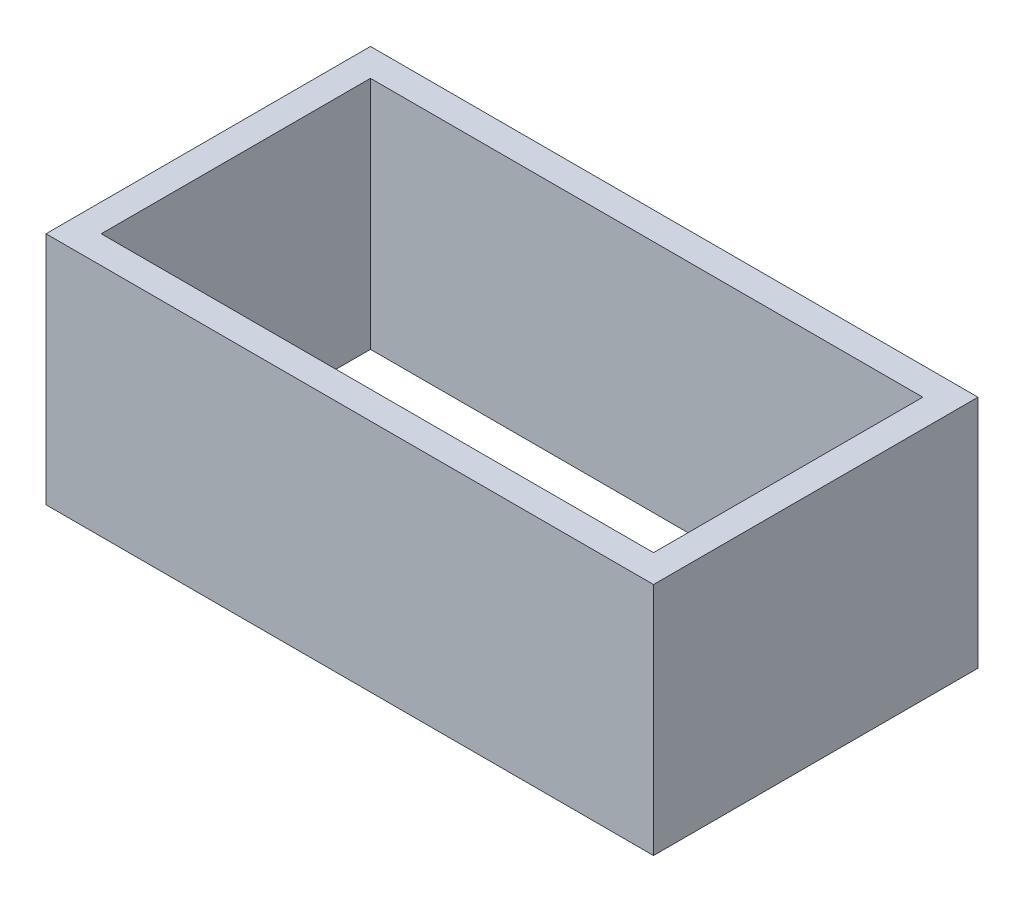
ISO-10303-21;
HEADER;
FILE_DESCRIPTION(('STEP AP214'),'2;1');
FILE_NAME('part.step','',(''),(''),'','','');
FILE_SCHEMA(('AUTOMOTIVE_DESIGN { 1 0 10303 214 1 1 1 1 }'));
ENDSEC;
DATA;
#1=APPLICATION_CONTEXT('core data for automotive mechanical design processes');
#2=APPLICATION_PROTOCOL_DEFINITION('international standard','automotive_design',2000,#1);
#3=PRODUCT_CONTEXT('',#1,'mechanical');
#4=PRODUCT('Part','Part','',(#3));
#5=PRODUCT_RELATED_PRODUCT_CATEGORY('part','',(#4));
#6=PRODUCT_DEFINITION_FORMATION('','',#4);
#7=PRODUCT_DEFINITION_CONTEXT('part definition',#1,'design');
#8=PRODUCT_DEFINITION('design','',#6,#7);
#9=PRODUCT_DEFINITION_SHAPE('','',#8);
#10=(LENGTH_UNIT() NAMED_UNIT(*) SI_UNIT(.MILLI.,.METRE.));
#11=(NAMED_UNIT(*) PLANE_ANGLE_UNIT() SI_UNIT($,.RADIAN.));
#12=(NAMED_UNIT(*) SI_UNIT($,.STERADIAN.) SOLID_ANGLE_UNIT());
#13=UNCERTAINTY_MEASURE_WITH_UNIT(LENGTH_MEASURE(1.E-05),#10,'distance_accuracy_value','');
#14=(GEOMETRIC_REPRESENTATION_CONTEXT(3) GLOBAL_UNCERTAINTY_ASSIGNED_CONTEXT((#13)) GLOBAL_UNIT_ASSIGNED_CONTEXT((#10,
#11,#12)) REPRESENTATION_CONTEXT('',''));
#15=CARTESIAN_POINT('',(0.,0.,0.));
#16=DIRECTION('',(0.,0.,1.));
#17=DIRECTION('',(1.,0.,0.));
#18=AXIS2_PLACEMENT_3D('',#15,#16,#17);
#19=CARTESIAN_POINT('',(0.,17.,0.));
#20=DIRECTION('',(0.,-1.,0.));
#21=DIRECTION('',(0.,0.,-1.));
#22=AXIS2_PLACEMENT_3D('',#19,#20,#21);
#23=PLANE('',#22);
#24=DIRECTION('',(1.,0.,0.));
#25=VECTOR('',#24,1.);
#26=CARTESIAN_POINT('',(22.,17.,11.75));
#27=LINE('',#26,#25);
#28=CARTESIAN_POINT('',(-22.,17.,11.75));
#29=VERTEX_POINT('',#28);
#30=CARTESIAN_POINT('',(22.,17.,11.75));
#31=VERTEX_POINT('',#30);
#32=EDGE_CURVE('E134',#29,#31,#27,.T.);
#33=ORIENTED_EDGE('',*,*,#32,.T.);
#34=DIRECTION('',(0.,0.,-1.));
#35=VECTOR('',#34,1.);
#36=CARTESIAN_POINT('',(22.,17.,11.75));
#37=LINE('',#36,#35);
#38=CARTESIAN_POINT('',(22.,17.,-11.75));
#39=VERTEX_POINT('',#38);
#40=EDGE_CURVE('E137',#31,#39,#37,.T.);
#41=ORIENTED_EDGE('',*,*,#40,.T.);
#42=DIRECTION('',(-1.,0.,0.));
#43=VECTOR('',#42,1.);
#44=CARTESIAN_POINT('',(22.,17.,-11.75));
#45=LINE('',#44,#43);
#46=CARTESIAN_POINT('',(-22.,17.,-11.75));
#47=VERTEX_POINT('',#46);
#48=EDGE_CURVE('E140',#39,#47,#45,.T.);
#49=ORIENTED_EDGE('',*,*,#48,.T.);
#50=DIRECTION('',(0.,0.,1.));
#51=VECTOR('',#50,1.);
#52=CARTESIAN_POINT('',(-22.,17.,11.75));
#53=LINE('',#52,#51);
#54=EDGE_CURVE('E142',#47,#29,#53,.T.);
#55=ORIENTED_EDGE('',*,*,#54,.T.);
#56=EDGE_LOOP('',(#33,#41,#49,#55));
#57=FACE_BOUND('',#56,.T.);
#58=DIRECTION('',(0.,0.,1.));
#59=VECTOR('',#58,1.);
#60=CARTESIAN_POINT('',(-20.,17.,9.75));
#61=LINE('',#60,#59);
#62=CARTESIAN_POINT('',(-20.,17.,-9.75));
#63=VERTEX_POINT('',#62);
#64=CARTESIAN_POINT('',(-20.,17.,9.75));
#65=VERTEX_POINT('',#64);
#66=EDGE_CURVE('E98',#63,#65,#61,.T.);
#67=ORIENTED_EDGE('',*,*,#66,.F.);
#68=DIRECTION('',(-1.,0.,0.));
#69=VECTOR('',#68,1.);
#70=CARTESIAN_POINT('',(20.,17.,-9.75));
#71=LINE('',#70,#69);
#72=CARTESIAN_POINT('',(20.,17.,-9.75));
#73=VERTEX_POINT('',#72);
#74=EDGE_CURVE('E120',#73,#63,#71,.T.);
#75=ORIENTED_EDGE('',*,*,#74,.F.);
#76=DIRECTION('',(0.,0.,-1.));
#77=VECTOR('',#76,1.);
#78=CARTESIAN_POINT('',(20.,17.,9.75));
#79=LINE('',#78,#77);
#80=CARTESIAN_POINT('',(20.,17.,9.75));
#81=VERTEX_POINT('',#80);
#82=EDGE_CURVE('E118',#81,#73,#79,.T.);
#83=ORIENTED_EDGE('',*,*,#82,.F.);
#84=DIRECTION('',(1.,0.,0.));
#85=VECTOR('',#84,1.);
#86=CARTESIAN_POINT('',(20.,17.,9.75));
#87=LINE('',#86,#85);
#88=EDGE_CURVE('E106',#65,#81,#87,.T.);
#89=ORIENTED_EDGE('',*,*,#88,.F.);
#90=EDGE_LOOP('',(#67,#75,#83,#89));
#91=FACE_BOUND('',#90,.T.);
#92=ADVANCED_FACE('F33',(#57,#91),#23,.F.);
#93=CARTESIAN_POINT('',(0.,0.,0.));
#94=DIRECTION('',(0.,-1.,0.));
#95=DIRECTION('',(0.,0.,-1.));
#96=AXIS2_PLACEMENT_3D('',#93,#94,#95);
#97=PLANE('',#96);
#98=DIRECTION('',(1.,0.,0.));
#99=VECTOR('',#98,1.);
#100=CARTESIAN_POINT('',(22.,0.,11.75));
#101=LINE('',#100,#99);
#102=CARTESIAN_POINT('',(-22.,0.,11.75));
#103=VERTEX_POINT('',#102);
#104=CARTESIAN_POINT('',(22.,0.,11.75));
#105=VERTEX_POINT('',#104);
#106=EDGE_CURVE('E114',#103,#105,#101,.T.);
#107=ORIENTED_EDGE('',*,*,#106,.F.);
#108=DIRECTION('',(0.,0.,1.));
#109=VECTOR('',#108,1.);
#110=CARTESIAN_POINT('',(-22.,0.,11.75));
#111=LINE('',#110,#109);
#112=CARTESIAN_POINT('',(-22.,0.,-11.75));
#113=VERTEX_POINT('',#112);
#114=EDGE_CURVE('E138',#113,#103,#111,.T.);
#115=ORIENTED_EDGE('',*,*,#114,.F.);
#116=DIRECTION('',(-1.,0.,0.));
#117=VECTOR('',#116,1.);
#118=CARTESIAN_POINT('',(22.,0.,-11.75));
#119=LINE('',#118,#117);
#120=CARTESIAN_POINT('',(22.,0.,-11.75));
#121=VERTEX_POINT('',#120);
#122=EDGE_CURVE('E149',#121,#113,#119,.T.);
#123=ORIENTED_EDGE('',*,*,#122,.F.);
#124=DIRECTION('',(0.,0.,-1.));
#125=VECTOR('',#124,1.);
#126=CARTESIAN_POINT('',(22.,0.,11.75));
#127=LINE('',#126,#125);
#128=EDGE_CURVE('E147',#105,#121,#127,.T.);
#129=ORIENTED_EDGE('',*,*,#128,.F.);
#130=EDGE_LOOP('',(#107,#115,#123,#129));
#131=FACE_BOUND('',#130,.T.);
#132=DIRECTION('',(-1.,0.,0.));
#133=VECTOR('',#132,1.);
#134=CARTESIAN_POINT('',(20.,0.,-9.75));
#135=LINE('',#134,#133);
#136=CARTESIAN_POINT('',(20.,0.,-9.75));
#137=VERTEX_POINT('',#136);
#138=CARTESIAN_POINT('',(-20.,0.,-9.75));
#139=VERTEX_POINT('',#138);
#140=EDGE_CURVE('E107',#137,#139,#135,.T.);
#141=ORIENTED_EDGE('',*,*,#140,.T.);
#142=DIRECTION('',(0.,0.,1.));
#143=VECTOR('',#142,1.);
#144=CARTESIAN_POINT('',(-20.,0.,9.75));
#145=LINE('',#144,#143);
#146=CARTESIAN_POINT('',(-20.,0.,9.75));
#147=VERTEX_POINT('',#146);
#148=EDGE_CURVE('E56',#139,#147,#145,.T.);
#149=ORIENTED_EDGE('',*,*,#148,.T.);
#150=DIRECTION('',(1.,0.,0.));
#151=VECTOR('',#150,1.);
#152=CARTESIAN_POINT('',(20.,0.,9.75));
#153=LINE('',#152,#151);
#154=CARTESIAN_POINT('',(20.,0.,9.75));
#155=VERTEX_POINT('',#154);
#156=EDGE_CURVE('E113',#147,#155,#153,.T.);
#157=ORIENTED_EDGE('',*,*,#156,.T.);
#158=DIRECTION('',(0.,0.,-1.));
#159=VECTOR('',#158,1.);
#160=CARTESIAN_POINT('',(20.,0.,9.75));
#161=LINE('',#160,#159);
#162=EDGE_CURVE('E126',#155,#137,#161,.T.);
#163=ORIENTED_EDGE('',*,*,#162,.T.);
#164=EDGE_LOOP('',(#141,#149,#157,#163));
#165=FACE_BOUND('',#164,.T.);
#166=ADVANCED_FACE('F167',(#131,#165),#97,.T.);
#167=CARTESIAN_POINT('',(22.,17.,11.75));
#168=DIRECTION('',(0.,0.,-1.));
#169=DIRECTION('',(-1.,0.,0.));
#170=AXIS2_PLACEMENT_3D('',#167,#168,#169);
#171=PLANE('',#170);
#172=ORIENTED_EDGE('',*,*,#106,.T.);
#173=DIRECTION('',(0.,-1.,0.));
#174=VECTOR('',#173,1.);
#175=CARTESIAN_POINT('',(22.,17.,11.75));
#176=LINE('',#175,#174);
#177=EDGE_CURVE('E11',#31,#105,#176,.T.);
#178=ORIENTED_EDGE('',*,*,#177,.F.);
#179=ORIENTED_EDGE('',*,*,#32,.F.);
#180=DIRECTION('',(0.,-1.,0.));
#181=VECTOR('',#180,1.);
#182=CARTESIAN_POINT('',(-22.,17.,11.75));
#183=LINE('',#182,#181);
#184=EDGE_CURVE('E144',#29,#103,#183,.T.);
#185=ORIENTED_EDGE('',*,*,#184,.T.);
#186=EDGE_LOOP('',(#172,#178,#179,#185));
#187=FACE_BOUND('',#186,.T.);
#188=ADVANCED_FACE('F35',(#187),#171,.F.);
#189=CARTESIAN_POINT('',(22.,17.,11.75));
#190=DIRECTION('',(-1.,0.,0.));
#191=DIRECTION('',(0.,0.,1.));
#192=AXIS2_PLACEMENT_3D('',#189,#190,#191);
#193=PLANE('',#192);
#194=ORIENTED_EDGE('',*,*,#128,.T.);
#195=DIRECTION('',(0.,-1.,0.));
#196=VECTOR('',#195,1.);
#197=CARTESIAN_POINT('',(22.,17.,-11.75));
#198=LINE('',#197,#196);
#199=EDGE_CURVE('E41',#39,#121,#198,.T.);
#200=ORIENTED_EDGE('',*,*,#199,.F.);
#201=ORIENTED_EDGE('',*,*,#40,.F.);
#202=ORIENTED_EDGE('',*,*,#177,.T.);
#203=EDGE_LOOP('',(#194,#200,#201,#202));
#204=FACE_BOUND('',#203,.T.);
#205=ADVANCED_FACE('F177',(#204),#193,.F.);
#206=CARTESIAN_POINT('',(22.,17.,-11.75));
#207=DIRECTION('',(0.,0.,1.));
#208=DIRECTION('',(1.,0.,0.));
#209=AXIS2_PLACEMENT_3D('',#206,#207,#208);
#210=PLANE('',#209);
#211=ORIENTED_EDGE('',*,*,#122,.T.);
#212=DIRECTION('',(0.,-1.,0.));
#213=VECTOR('',#212,1.);
#214=CARTESIAN_POINT('',(-22.,17.,-11.75));
#215=LINE('',#214,#213);
#216=EDGE_CURVE('E154',#47,#113,#215,.T.);
#217=ORIENTED_EDGE('',*,*,#216,.F.);
#218=ORIENTED_EDGE('',*,*,#48,.F.);
#219=ORIENTED_EDGE('',*,*,#199,.T.);
#220=EDGE_LOOP('',(#211,#217,#218,#219));
#221=FACE_BOUND('',#220,.T.);
#222=ADVANCED_FACE('F161',(#221),#210,.F.);
#223=CARTESIAN_POINT('',(-22.,17.,11.75));
#224=DIRECTION('',(1.,0.,0.));
#225=DIRECTION('',(0.,0.,-1.));
#226=AXIS2_PLACEMENT_3D('',#223,#224,#225);
#227=PLANE('',#226);
#228=ORIENTED_EDGE('',*,*,#114,.T.);
#229=ORIENTED_EDGE('',*,*,#184,.F.);
#230=ORIENTED_EDGE('',*,*,#54,.F.);
#231=ORIENTED_EDGE('',*,*,#216,.T.);
#232=EDGE_LOOP('',(#228,#229,#230,#231));
#233=FACE_BOUND('',#232,.T.);
#234=ADVANCED_FACE('F171',(#233),#227,.F.);
#235=CARTESIAN_POINT('',(-20.,17.,9.75));
#236=DIRECTION('',(1.,0.,0.));
#237=DIRECTION('',(0.,0.,-1.));
#238=AXIS2_PLACEMENT_3D('',#235,#236,#237);
#239=PLANE('',#238);
#240=ORIENTED_EDGE('',*,*,#148,.F.);
#241=DIRECTION('',(0.,-1.,0.));
#242=VECTOR('',#241,1.);
#243=CARTESIAN_POINT('',(-20.,17.,-9.75));
#244=LINE('',#243,#242);
#245=EDGE_CURVE('E102',#63,#139,#244,.T.);
#246=ORIENTED_EDGE('',*,*,#245,.F.);
#247=ORIENTED_EDGE('',*,*,#66,.T.);
#248=DIRECTION('',(0.,-1.,0.));
#249=VECTOR('',#248,1.);
#250=CARTESIAN_POINT('',(-20.,17.,9.75));
#251=LINE('',#250,#249);
#252=EDGE_CURVE('E101',#65,#147,#251,.T.);
#253=ORIENTED_EDGE('',*,*,#252,.T.);
#254=EDGE_LOOP('',(#240,#246,#247,#253));
#255=FACE_BOUND('',#254,.T.);
#256=ADVANCED_FACE('F100',(#255),#239,.T.);
#257=CARTESIAN_POINT('',(20.,17.,9.75));
#258=DIRECTION('',(0.,0.,-1.));
#259=DIRECTION('',(-1.,0.,0.));
#260=AXIS2_PLACEMENT_3D('',#257,#258,#259);
#261=PLANE('',#260);
#262=ORIENTED_EDGE('',*,*,#156,.F.);
#263=ORIENTED_EDGE('',*,*,#252,.F.);
#264=ORIENTED_EDGE('',*,*,#88,.T.);
#265=DIRECTION('',(0.,-1.,0.));
#266=VECTOR('',#265,1.);
#267=CARTESIAN_POINT('',(20.,17.,9.75));
#268=LINE('',#267,#266);
#269=EDGE_CURVE('E115',#81,#155,#268,.T.);
#270=ORIENTED_EDGE('',*,*,#269,.T.);
#271=EDGE_LOOP('',(#262,#263,#264,#270));
#272=FACE_BOUND('',#271,.T.);
#273=ADVANCED_FACE('F110',(#272),#261,.T.);
#274=CARTESIAN_POINT('',(20.,17.,9.75));
#275=DIRECTION('',(-1.,0.,0.));
#276=DIRECTION('',(0.,0.,1.));
#277=AXIS2_PLACEMENT_3D('',#274,#275,#276);
#278=PLANE('',#277);
#279=ORIENTED_EDGE('',*,*,#162,.F.);
#280=ORIENTED_EDGE('',*,*,#269,.F.);
#281=ORIENTED_EDGE('',*,*,#82,.T.);
#282=DIRECTION('',(0.,-1.,0.));
#283=VECTOR('',#282,1.);
#284=CARTESIAN_POINT('',(20.,17.,-9.75));
#285=LINE('',#284,#283);
#286=EDGE_CURVE('E48',#73,#137,#285,.T.);
#287=ORIENTED_EDGE('',*,*,#286,.T.);
#288=EDGE_LOOP('',(#279,#280,#281,#287));
#289=FACE_BOUND('',#288,.T.);
#290=ADVANCED_FACE('F200',(#289),#278,.T.);
#291=CARTESIAN_POINT('',(20.,17.,-9.75));
#292=DIRECTION('',(0.,0.,1.));
#293=DIRECTION('',(1.,0.,0.));
#294=AXIS2_PLACEMENT_3D('',#291,#292,#293);
#295=PLANE('',#294);
#296=ORIENTED_EDGE('',*,*,#140,.F.);
#297=ORIENTED_EDGE('',*,*,#286,.F.);
#298=ORIENTED_EDGE('',*,*,#74,.T.);
#299=ORIENTED_EDGE('',*,*,#245,.T.);
#300=EDGE_LOOP('',(#296,#297,#298,#299));
#301=FACE_BOUND('',#300,.T.);
#302=ADVANCED_FACE('F204',(#301),#295,.T.);
#303=CLOSED_SHELL('',(#92,#166,#188,#205,#222,#234,#256,#273,#290,#302));
#304=MANIFOLD_SOLID_BREP('B2',#303);
#305=ADVANCED_BREP_SHAPE_REPRESENTATION('',(#18,#304),#14);
#306=SHAPE_DEFINITION_REPRESENTATION(#9,#305);
ENDSEC;
END-ISO-10303-21;
